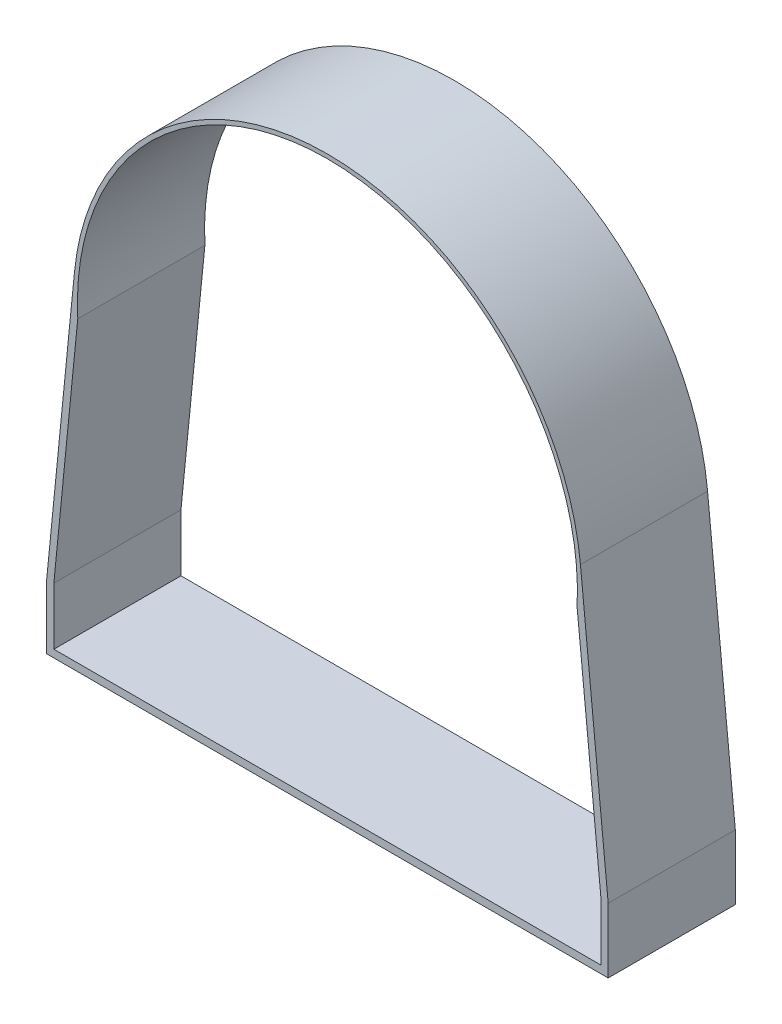
ISO-10303-21;
HEADER;
FILE_DESCRIPTION(('STEP AP214'),'2;1');
FILE_NAME('part.step','',(''),(''),'','','');
FILE_SCHEMA(('AUTOMOTIVE_DESIGN { 1 0 10303 214 1 1 1 1 }'));
ENDSEC;
DATA;
#1=APPLICATION_CONTEXT('core data for automotive mechanical design processes');
#2=APPLICATION_PROTOCOL_DEFINITION('international standard','automotive_design',2000,#1);
#3=PRODUCT_CONTEXT('',#1,'mechanical');
#4=PRODUCT('Part','Part','',(#3));
#5=PRODUCT_RELATED_PRODUCT_CATEGORY('part','',(#4));
#6=PRODUCT_DEFINITION_FORMATION('','',#4);
#7=PRODUCT_DEFINITION_CONTEXT('part definition',#1,'design');
#8=PRODUCT_DEFINITION('design','',#6,#7);
#9=PRODUCT_DEFINITION_SHAPE('','',#8);
#10=(LENGTH_UNIT() NAMED_UNIT(*) SI_UNIT(.MILLI.,.METRE.));
#11=(NAMED_UNIT(*) PLANE_ANGLE_UNIT() SI_UNIT($,.RADIAN.));
#12=(NAMED_UNIT(*) SI_UNIT($,.STERADIAN.) SOLID_ANGLE_UNIT());
#13=UNCERTAINTY_MEASURE_WITH_UNIT(LENGTH_MEASURE(1.E-05),#10,'distance_accuracy_value','');
#14=(GEOMETRIC_REPRESENTATION_CONTEXT(3) GLOBAL_UNCERTAINTY_ASSIGNED_CONTEXT((#13)) GLOBAL_UNIT_ASSIGNED_CONTEXT((#10,
#11,#12)) REPRESENTATION_CONTEXT('',''));
#15=CARTESIAN_POINT('',(0.,0.,0.));
#16=DIRECTION('',(0.,0.,1.));
#17=DIRECTION('',(1.,0.,0.));
#18=AXIS2_PLACEMENT_3D('',#15,#16,#17);
#19=CARTESIAN_POINT('',(0.,0.,19.05));
#20=DIRECTION('',(0.,0.,1.));
#21=DIRECTION('',(1.,0.,0.));
#22=AXIS2_PLACEMENT_3D('',#19,#20,#21);
#23=PLANE('',#22);
#24=CARTESIAN_POINT('',(0.,0.,19.05));
#25=DIRECTION('',(0.,0.,1.));
#26=DIRECTION('',(1.,0.,0.));
#27=AXIS2_PLACEMENT_3D('',#24,#25,#26);
#28=CIRCLE('',#27,38.1);
#29=CARTESIAN_POINT('',(37.9137826163487,3.76232477601981,19.05));
#30=VERTEX_POINT('',#29);
#31=CARTESIAN_POINT('',(-37.9137826163487,3.7623247760198,19.05));
#32=VERTEX_POINT('',#31);
#33=EDGE_CURVE('E198',#30,#32,#28,.T.);
#34=ORIENTED_EDGE('',*,*,#33,.T.);
#35=DIRECTION('',(-0.0987486817852968,-0.995112404628576,0.));
#36=VECTOR('',#35,1.);
#37=CARTESIAN_POINT('',(-37.9137826163487,3.7623247760198,19.05));
#38=LINE('',#37,#36);
#39=CARTESIAN_POINT('',(-42.0679358244407,-38.1,19.05));
#40=VERTEX_POINT('',#39);
#41=EDGE_CURVE('E202',#32,#40,#38,.T.);
#42=ORIENTED_EDGE('',*,*,#41,.T.);
#43=DIRECTION('',(0.,-1.,0.));
#44=VECTOR('',#43,1.);
#45=CARTESIAN_POINT('',(-42.0679358244407,-38.1,19.05));
#46=LINE('',#45,#44);
#47=CARTESIAN_POINT('',(-42.0679358244407,-47.8074933391786,19.05));
#48=VERTEX_POINT('',#47);
#49=EDGE_CURVE('E206',#40,#48,#46,.T.);
#50=ORIENTED_EDGE('',*,*,#49,.T.);
#51=DIRECTION('',(1.,0.,0.));
#52=VECTOR('',#51,1.);
#53=CARTESIAN_POINT('',(-42.0679358244407,-47.8074933391786,19.05));
#54=LINE('',#53,#52);
#55=CARTESIAN_POINT('',(42.0679358244407,-47.8074933391786,19.05));
#56=VERTEX_POINT('',#55);
#57=EDGE_CURVE('E209',#48,#56,#54,.T.);
#58=ORIENTED_EDGE('',*,*,#57,.T.);
#59=DIRECTION('',(0.,1.,0.));
#60=VECTOR('',#59,1.);
#61=CARTESIAN_POINT('',(42.0679358244407,-47.8074933391786,19.05));
#62=LINE('',#61,#60);
#63=CARTESIAN_POINT('',(42.0679358244407,-38.1,19.05));
#64=VERTEX_POINT('',#63);
#65=EDGE_CURVE('E212',#56,#64,#62,.T.);
#66=ORIENTED_EDGE('',*,*,#65,.T.);
#67=DIRECTION('',(-0.0987486817852969,0.995112404628576,0.));
#68=VECTOR('',#67,1.);
#69=CARTESIAN_POINT('',(37.9137826163487,3.76232477601981,19.05));
#70=LINE('',#69,#68);
#71=EDGE_CURVE('E215',#64,#30,#70,.T.);
#72=ORIENTED_EDGE('',*,*,#71,.T.);
#73=EDGE_LOOP('',(#34,#42,#50,#58,#66,#72));
#74=FACE_BOUND('',#73,.T.);
#75=DIRECTION('',(-0.0987486817852966,-0.995112404628576,0.));
#76=VECTOR('',#75,1.);
#77=CARTESIAN_POINT('',(-37.4122641520567,-1.98713764413552,19.05));
#78=LINE('',#77,#76);
#79=CARTESIAN_POINT('',(-37.4122641520567,-1.98713764413552,19.05));
#80=VERTEX_POINT('',#79);
#81=CARTESIAN_POINT('',(-40.9958769545385,-38.1,19.05));
#82=VERTEX_POINT('',#81);
#83=EDGE_CURVE('E138',#80,#82,#78,.T.);
#84=ORIENTED_EDGE('',*,*,#83,.F.);
#85=CARTESIAN_POINT('',(0.,0.,19.05));
#86=DIRECTION('',(0.,0.,1.));
#87=DIRECTION('',(-1.,0.,0.));
#88=AXIS2_PLACEMENT_3D('',#85,#86,#87);
#89=CIRCLE('',#88,37.4650000000001);
#90=CARTESIAN_POINT('',(37.4122644250598,-1.98713250424008,19.05));
#91=VERTEX_POINT('',#90);
#92=EDGE_CURVE('E129',#91,#80,#89,.T.);
#93=ORIENTED_EDGE('',*,*,#92,.F.);
#94=DIRECTION('',(-0.0987486817852967,0.995112404628576,0.));
#95=VECTOR('',#94,1.);
#96=CARTESIAN_POINT('',(37.4122644250598,-1.98713250424008,19.05));
#97=LINE('',#96,#95);
#98=CARTESIAN_POINT('',(40.9958769545383,-38.099992108989,19.05));
#99=VERTEX_POINT('',#98);
#100=EDGE_CURVE('E164',#99,#91,#97,.T.);
#101=ORIENTED_EDGE('',*,*,#100,.F.);
#102=DIRECTION('',(0.,1.,0.));
#103=VECTOR('',#102,1.);
#104=CARTESIAN_POINT('',(40.9958769545383,-38.099992108989,19.05));
#105=LINE('',#104,#103);
#106=CARTESIAN_POINT('',(40.9958769545383,-46.6725,19.05));
#107=VERTEX_POINT('',#106);
#108=EDGE_CURVE('E161',#107,#99,#105,.T.);
#109=ORIENTED_EDGE('',*,*,#108,.F.);
#110=DIRECTION('',(1.,0.,0.));
#111=VECTOR('',#110,1.);
#112=CARTESIAN_POINT('',(-40.9958769545385,-46.6725,19.05));
#113=LINE('',#112,#111);
#114=CARTESIAN_POINT('',(-40.9958769545385,-46.6725,19.05));
#115=VERTEX_POINT('',#114);
#116=EDGE_CURVE('E156',#115,#107,#113,.T.);
#117=ORIENTED_EDGE('',*,*,#116,.F.);
#118=DIRECTION('',(0.,-1.,0.));
#119=VECTOR('',#118,1.);
#120=CARTESIAN_POINT('',(-40.9958769545385,-38.1,19.05));
#121=LINE('',#120,#119);
#122=EDGE_CURVE('E152',#82,#115,#121,.T.);
#123=ORIENTED_EDGE('',*,*,#122,.F.);
#124=EDGE_LOOP('',(#84,#93,#101,#109,#117,#123));
#125=FACE_BOUND('',#124,.T.);
#126=ADVANCED_FACE('F39',(#74,#125),#23,.T.);
#127=CARTESIAN_POINT('',(0.,0.,0.));
#128=DIRECTION('',(0.,0.,1.));
#129=DIRECTION('',(1.,0.,0.));
#130=AXIS2_PLACEMENT_3D('',#127,#128,#129);
#131=PLANE('',#130);
#132=CARTESIAN_POINT('',(0.,0.,0.));
#133=DIRECTION('',(0.,0.,1.));
#134=DIRECTION('',(1.,0.,0.));
#135=AXIS2_PLACEMENT_3D('',#132,#133,#134);
#136=CIRCLE('',#135,38.1);
#137=CARTESIAN_POINT('',(37.9137826163487,3.76232477601981,0.));
#138=VERTEX_POINT('',#137);
#139=CARTESIAN_POINT('',(-37.9137826163487,3.7623247760198,0.));
#140=VERTEX_POINT('',#139);
#141=EDGE_CURVE('E147',#138,#140,#136,.T.);
#142=ORIENTED_EDGE('',*,*,#141,.F.);
#143=DIRECTION('',(-0.0987486817852969,0.995112404628576,0.));
#144=VECTOR('',#143,1.);
#145=CARTESIAN_POINT('',(37.9137826163487,3.76232477601981,0.));
#146=LINE('',#145,#144);
#147=CARTESIAN_POINT('',(42.0679358244407,-38.1,0.));
#148=VERTEX_POINT('',#147);
#149=EDGE_CURVE('E203',#148,#138,#146,.T.);
#150=ORIENTED_EDGE('',*,*,#149,.F.);
#151=DIRECTION('',(0.,1.,0.));
#152=VECTOR('',#151,1.);
#153=CARTESIAN_POINT('',(42.0679358244407,-47.8074933391786,0.));
#154=LINE('',#153,#152);
#155=CARTESIAN_POINT('',(42.0679358244407,-47.8074933391786,0.));
#156=VERTEX_POINT('',#155);
#157=EDGE_CURVE('E231',#156,#148,#154,.T.);
#158=ORIENTED_EDGE('',*,*,#157,.F.);
#159=DIRECTION('',(1.,0.,0.));
#160=VECTOR('',#159,1.);
#161=CARTESIAN_POINT('',(-42.0679358244407,-47.8074933391786,0.));
#162=LINE('',#161,#160);
#163=CARTESIAN_POINT('',(-42.0679358244407,-47.8074933391786,0.));
#164=VERTEX_POINT('',#163);
#165=EDGE_CURVE('E228',#164,#156,#162,.T.);
#166=ORIENTED_EDGE('',*,*,#165,.F.);
#167=DIRECTION('',(0.,-1.,0.));
#168=VECTOR('',#167,1.);
#169=CARTESIAN_POINT('',(-42.0679358244407,-38.1,0.));
#170=LINE('',#169,#168);
#171=CARTESIAN_POINT('',(-42.0679358244407,-38.1,0.));
#172=VERTEX_POINT('',#171);
#173=EDGE_CURVE('E225',#172,#164,#170,.T.);
#174=ORIENTED_EDGE('',*,*,#173,.F.);
#175=DIRECTION('',(-0.0987486817852968,-0.995112404628576,0.));
#176=VECTOR('',#175,1.);
#177=CARTESIAN_POINT('',(-37.9137826163487,3.7623247760198,0.));
#178=LINE('',#177,#176);
#179=EDGE_CURVE('E222',#140,#172,#178,.T.);
#180=ORIENTED_EDGE('',*,*,#179,.F.);
#181=EDGE_LOOP('',(#142,#150,#158,#166,#174,#180));
#182=FACE_BOUND('',#181,.T.);
#183=CARTESIAN_POINT('',(0.,0.,0.));
#184=DIRECTION('',(0.,0.,1.));
#185=DIRECTION('',(-1.,0.,0.));
#186=AXIS2_PLACEMENT_3D('',#183,#184,#185);
#187=CIRCLE('',#186,37.4650000000001);
#188=CARTESIAN_POINT('',(37.4122644250598,-1.98713250424008,0.));
#189=VERTEX_POINT('',#188);
#190=CARTESIAN_POINT('',(-37.4122641520567,-1.98713764413552,0.));
#191=VERTEX_POINT('',#190);
#192=EDGE_CURVE('E63',#189,#191,#187,.T.);
#193=ORIENTED_EDGE('',*,*,#192,.T.);
#194=DIRECTION('',(-0.0987486817852966,-0.995112404628576,0.));
#195=VECTOR('',#194,1.);
#196=CARTESIAN_POINT('',(-37.4122641520567,-1.98713764413552,0.));
#197=LINE('',#196,#195);
#198=CARTESIAN_POINT('',(-40.9958769545385,-38.1,0.));
#199=VERTEX_POINT('',#198);
#200=EDGE_CURVE('E145',#191,#199,#197,.T.);
#201=ORIENTED_EDGE('',*,*,#200,.T.);
#202=DIRECTION('',(0.,-1.,0.));
#203=VECTOR('',#202,1.);
#204=CARTESIAN_POINT('',(-40.9958769545385,-38.1,0.));
#205=LINE('',#204,#203);
#206=CARTESIAN_POINT('',(-40.9958769545385,-46.6725,0.));
#207=VERTEX_POINT('',#206);
#208=EDGE_CURVE('E171',#199,#207,#205,.T.);
#209=ORIENTED_EDGE('',*,*,#208,.T.);
#210=DIRECTION('',(1.,0.,0.));
#211=VECTOR('',#210,1.);
#212=CARTESIAN_POINT('',(-40.9958769545385,-46.6725,0.));
#213=LINE('',#212,#211);
#214=CARTESIAN_POINT('',(40.9958769545383,-46.6725,0.));
#215=VERTEX_POINT('',#214);
#216=EDGE_CURVE('E175',#207,#215,#213,.T.);
#217=ORIENTED_EDGE('',*,*,#216,.T.);
#218=DIRECTION('',(0.,1.,0.));
#219=VECTOR('',#218,1.);
#220=CARTESIAN_POINT('',(40.9958769545383,-38.099992108989,0.));
#221=LINE('',#220,#219);
#222=CARTESIAN_POINT('',(40.9958769545383,-38.099992108989,0.));
#223=VERTEX_POINT('',#222);
#224=EDGE_CURVE('E179',#215,#223,#221,.T.);
#225=ORIENTED_EDGE('',*,*,#224,.T.);
#226=DIRECTION('',(-0.0987486817852967,0.995112404628576,0.));
#227=VECTOR('',#226,1.);
#228=CARTESIAN_POINT('',(37.4122644250598,-1.98713250424008,0.));
#229=LINE('',#228,#227);
#230=EDGE_CURVE('E139',#223,#189,#229,.T.);
#231=ORIENTED_EDGE('',*,*,#230,.T.);
#232=EDGE_LOOP('',(#193,#201,#209,#217,#225,#231));
#233=FACE_BOUND('',#232,.T.);
#234=ADVANCED_FACE('F262',(#182,#233),#131,.F.);
#235=CARTESIAN_POINT('',(0.,0.,19.05));
#236=DIRECTION('',(0.,0.,-1.));
#237=DIRECTION('',(-1.,0.,0.));
#238=AXIS2_PLACEMENT_3D('',#235,#236,#237);
#239=CYLINDRICAL_SURFACE('',#238,38.1);
#240=ORIENTED_EDGE('',*,*,#141,.T.);
#241=DIRECTION('',(0.,0.,-1.));
#242=VECTOR('',#241,1.);
#243=CARTESIAN_POINT('',(-37.9137826163487,3.7623247760198,19.05));
#244=LINE('',#243,#242);
#245=EDGE_CURVE('E11',#32,#140,#244,.T.);
#246=ORIENTED_EDGE('',*,*,#245,.F.);
#247=ORIENTED_EDGE('',*,*,#33,.F.);
#248=DIRECTION('',(0.,0.,-1.));
#249=VECTOR('',#248,1.);
#250=CARTESIAN_POINT('',(37.9137826163487,3.76232477601981,19.05));
#251=LINE('',#250,#249);
#252=EDGE_CURVE('E218',#30,#138,#251,.T.);
#253=ORIENTED_EDGE('',*,*,#252,.T.);
#254=EDGE_LOOP('',(#240,#246,#247,#253));
#255=FACE_BOUND('',#254,.T.);
#256=ADVANCED_FACE('F41',(#255),#239,.T.);
#257=CARTESIAN_POINT('',(-37.9137826163487,3.7623247760198,19.05));
#258=DIRECTION('',(0.995112404628576,-0.0987486817852968,0.));
#259=DIRECTION('',(0.0987486817852968,0.995112404628576,0.));
#260=AXIS2_PLACEMENT_3D('',#257,#258,#259);
#261=PLANE('',#260);
#262=ORIENTED_EDGE('',*,*,#179,.T.);
#263=DIRECTION('',(0.,0.,-1.));
#264=VECTOR('',#263,1.);
#265=CARTESIAN_POINT('',(-42.0679358244407,-38.1,19.05));
#266=LINE('',#265,#264);
#267=EDGE_CURVE('E48',#40,#172,#266,.T.);
#268=ORIENTED_EDGE('',*,*,#267,.F.);
#269=ORIENTED_EDGE('',*,*,#41,.F.);
#270=ORIENTED_EDGE('',*,*,#245,.T.);
#271=EDGE_LOOP('',(#262,#268,#269,#270));
#272=FACE_BOUND('',#271,.T.);
#273=ADVANCED_FACE('F279',(#272),#261,.F.);
#274=CARTESIAN_POINT('',(-42.0679358244407,-38.1,19.05));
#275=DIRECTION('',(1.,0.,0.));
#276=DIRECTION('',(0.,1.,0.));
#277=AXIS2_PLACEMENT_3D('',#274,#275,#276);
#278=PLANE('',#277);
#279=ORIENTED_EDGE('',*,*,#173,.T.);
#280=DIRECTION('',(0.,0.,-1.));
#281=VECTOR('',#280,1.);
#282=CARTESIAN_POINT('',(-42.0679358244407,-47.8074933391786,19.05));
#283=LINE('',#282,#281);
#284=EDGE_CURVE('E247',#48,#164,#283,.T.);
#285=ORIENTED_EDGE('',*,*,#284,.F.);
#286=ORIENTED_EDGE('',*,*,#49,.F.);
#287=ORIENTED_EDGE('',*,*,#267,.T.);
#288=EDGE_LOOP('',(#279,#285,#286,#287));
#289=FACE_BOUND('',#288,.T.);
#290=ADVANCED_FACE('F256',(#289),#278,.F.);
#291=CARTESIAN_POINT('',(-42.0679358244407,-47.8074933391786,19.05));
#292=DIRECTION('',(0.,1.,0.));
#293=DIRECTION('',(0.,0.,1.));
#294=AXIS2_PLACEMENT_3D('',#291,#292,#293);
#295=PLANE('',#294);
#296=ORIENTED_EDGE('',*,*,#165,.T.);
#297=DIRECTION('',(0.,0.,-1.));
#298=VECTOR('',#297,1.);
#299=CARTESIAN_POINT('',(42.0679358244407,-47.8074933391786,19.05));
#300=LINE('',#299,#298);
#301=EDGE_CURVE('E243',#56,#156,#300,.T.);
#302=ORIENTED_EDGE('',*,*,#301,.F.);
#303=ORIENTED_EDGE('',*,*,#57,.F.);
#304=ORIENTED_EDGE('',*,*,#284,.T.);
#305=EDGE_LOOP('',(#296,#302,#303,#304));
#306=FACE_BOUND('',#305,.T.);
#307=ADVANCED_FACE('F268',(#306),#295,.F.);
#308=CARTESIAN_POINT('',(42.0679358244407,-47.8074933391786,19.05));
#309=DIRECTION('',(-1.,0.,0.));
#310=DIRECTION('',(0.,0.,1.));
#311=AXIS2_PLACEMENT_3D('',#308,#309,#310);
#312=PLANE('',#311);
#313=ORIENTED_EDGE('',*,*,#157,.T.);
#314=DIRECTION('',(0.,0.,-1.));
#315=VECTOR('',#314,1.);
#316=CARTESIAN_POINT('',(42.0679358244407,-38.1,19.05));
#317=LINE('',#316,#315);
#318=EDGE_CURVE('E239',#64,#148,#317,.T.);
#319=ORIENTED_EDGE('',*,*,#318,.F.);
#320=ORIENTED_EDGE('',*,*,#65,.F.);
#321=ORIENTED_EDGE('',*,*,#301,.T.);
#322=EDGE_LOOP('',(#313,#319,#320,#321));
#323=FACE_BOUND('',#322,.T.);
#324=ADVANCED_FACE('F272',(#323),#312,.F.);
#325=CARTESIAN_POINT('',(37.9137826163487,3.76232477601981,19.05));
#326=DIRECTION('',(-0.995112404628576,-0.0987486817852969,0.));
#327=DIRECTION('',(0.0987486817852969,-0.995112404628576,0.));
#328=AXIS2_PLACEMENT_3D('',#325,#326,#327);
#329=PLANE('',#328);
#330=ORIENTED_EDGE('',*,*,#149,.T.);
#331=ORIENTED_EDGE('',*,*,#252,.F.);
#332=ORIENTED_EDGE('',*,*,#71,.F.);
#333=ORIENTED_EDGE('',*,*,#318,.T.);
#334=EDGE_LOOP('',(#330,#331,#332,#333));
#335=FACE_BOUND('',#334,.T.);
#336=ADVANCED_FACE('F282',(#335),#329,.F.);
#337=CARTESIAN_POINT('',(0.,0.,19.05));
#338=DIRECTION('',(0.,0.,-1.));
#339=DIRECTION('',(-1.,0.,0.));
#340=AXIS2_PLACEMENT_3D('',#337,#338,#339);
#341=CYLINDRICAL_SURFACE('',#340,37.4650000000001);
#342=ORIENTED_EDGE('',*,*,#192,.F.);
#343=DIRECTION('',(0.,0.,-1.));
#344=VECTOR('',#343,1.);
#345=CARTESIAN_POINT('',(37.4122644250598,-1.98713250424008,19.05));
#346=LINE('',#345,#344);
#347=EDGE_CURVE('E133',#91,#189,#346,.T.);
#348=ORIENTED_EDGE('',*,*,#347,.F.);
#349=ORIENTED_EDGE('',*,*,#92,.T.);
#350=DIRECTION('',(0.,0.,-1.));
#351=VECTOR('',#350,1.);
#352=CARTESIAN_POINT('',(-37.4122641520567,-1.98713764413552,19.05));
#353=LINE('',#352,#351);
#354=EDGE_CURVE('E132',#80,#191,#353,.T.);
#355=ORIENTED_EDGE('',*,*,#354,.T.);
#356=EDGE_LOOP('',(#342,#348,#349,#355));
#357=FACE_BOUND('',#356,.T.);
#358=ADVANCED_FACE('F131',(#357),#341,.F.);
#359=CARTESIAN_POINT('',(-37.4122641520567,-1.98713764413552,19.05));
#360=DIRECTION('',(0.995112404628576,-0.0987486817852966,0.));
#361=DIRECTION('',(0.0987486817852966,0.995112404628576,0.));
#362=AXIS2_PLACEMENT_3D('',#359,#360,#361);
#363=PLANE('',#362);
#364=ORIENTED_EDGE('',*,*,#200,.F.);
#365=ORIENTED_EDGE('',*,*,#354,.F.);
#366=ORIENTED_EDGE('',*,*,#83,.T.);
#367=DIRECTION('',(0.,0.,-1.));
#368=VECTOR('',#367,1.);
#369=CARTESIAN_POINT('',(-40.9958769545385,-38.1,19.05));
#370=LINE('',#369,#368);
#371=EDGE_CURVE('E148',#82,#199,#370,.T.);
#372=ORIENTED_EDGE('',*,*,#371,.T.);
#373=EDGE_LOOP('',(#364,#365,#366,#372));
#374=FACE_BOUND('',#373,.T.);
#375=ADVANCED_FACE('F142',(#374),#363,.T.);
#376=CARTESIAN_POINT('',(-40.9958769545385,-38.1,19.05));
#377=DIRECTION('',(1.,0.,0.));
#378=DIRECTION('',(0.,0.,-1.));
#379=AXIS2_PLACEMENT_3D('',#376,#377,#378);
#380=PLANE('',#379);
#381=ORIENTED_EDGE('',*,*,#208,.F.);
#382=ORIENTED_EDGE('',*,*,#371,.F.);
#383=ORIENTED_EDGE('',*,*,#122,.T.);
#384=DIRECTION('',(0.,0.,-1.));
#385=VECTOR('',#384,1.);
#386=CARTESIAN_POINT('',(-40.9958769545385,-46.6725,19.05));
#387=LINE('',#386,#385);
#388=EDGE_CURVE('E193',#115,#207,#387,.T.);
#389=ORIENTED_EDGE('',*,*,#388,.T.);
#390=EDGE_LOOP('',(#381,#382,#383,#389));
#391=FACE_BOUND('',#390,.T.);
#392=ADVANCED_FACE('F300',(#391),#380,.T.);
#393=CARTESIAN_POINT('',(-40.9958769545385,-46.6725,19.05));
#394=DIRECTION('',(0.,1.,0.));
#395=DIRECTION('',(0.,0.,1.));
#396=AXIS2_PLACEMENT_3D('',#393,#394,#395);
#397=PLANE('',#396);
#398=ORIENTED_EDGE('',*,*,#216,.F.);
#399=ORIENTED_EDGE('',*,*,#388,.F.);
#400=ORIENTED_EDGE('',*,*,#116,.T.);
#401=DIRECTION('',(0.,0.,-1.));
#402=VECTOR('',#401,1.);
#403=CARTESIAN_POINT('',(40.9958769545383,-46.6725,19.05));
#404=LINE('',#403,#402);
#405=EDGE_CURVE('E190',#107,#215,#404,.T.);
#406=ORIENTED_EDGE('',*,*,#405,.T.);
#407=EDGE_LOOP('',(#398,#399,#400,#406));
#408=FACE_BOUND('',#407,.T.);
#409=ADVANCED_FACE('F303',(#408),#397,.T.);
#410=CARTESIAN_POINT('',(40.9958769545383,-38.099992108989,19.05));
#411=DIRECTION('',(-1.,0.,0.));
#412=DIRECTION('',(0.,-1.,0.));
#413=AXIS2_PLACEMENT_3D('',#410,#411,#412);
#414=PLANE('',#413);
#415=ORIENTED_EDGE('',*,*,#224,.F.);
#416=ORIENTED_EDGE('',*,*,#405,.F.);
#417=ORIENTED_EDGE('',*,*,#108,.T.);
#418=DIRECTION('',(0.,0.,-1.));
#419=VECTOR('',#418,1.);
#420=CARTESIAN_POINT('',(40.9958769545383,-38.099992108989,19.05));
#421=LINE('',#420,#419);
#422=EDGE_CURVE('E55',#99,#223,#421,.T.);
#423=ORIENTED_EDGE('',*,*,#422,.T.);
#424=EDGE_LOOP('',(#415,#416,#417,#423));
#425=FACE_BOUND('',#424,.T.);
#426=ADVANCED_FACE('F307',(#425),#414,.T.);
#427=CARTESIAN_POINT('',(37.4122644250598,-1.98713250424008,19.05));
#428=DIRECTION('',(-0.995112404628576,-0.0987486817852967,0.));
#429=DIRECTION('',(0.0987486817852968,-0.995112404628576,0.));
#430=AXIS2_PLACEMENT_3D('',#427,#428,#429);
#431=PLANE('',#430);
#432=ORIENTED_EDGE('',*,*,#230,.F.);
#433=ORIENTED_EDGE('',*,*,#422,.F.);
#434=ORIENTED_EDGE('',*,*,#100,.T.);
#435=ORIENTED_EDGE('',*,*,#347,.T.);
#436=EDGE_LOOP('',(#432,#433,#434,#435));
#437=FACE_BOUND('',#436,.T.);
#438=ADVANCED_FACE('F311',(#437),#431,.T.);
#439=CLOSED_SHELL('',(#126,#234,#256,#273,#290,#307,#324,#336,#358,#375,#392,#409,#426,#438));
#440=MANIFOLD_SOLID_BREP('B2',#439);
#441=ADVANCED_BREP_SHAPE_REPRESENTATION('',(#18,#440),#14);
#442=SHAPE_DEFINITION_REPRESENTATION(#9,#441);
ENDSEC;
END-ISO-10303-21;
